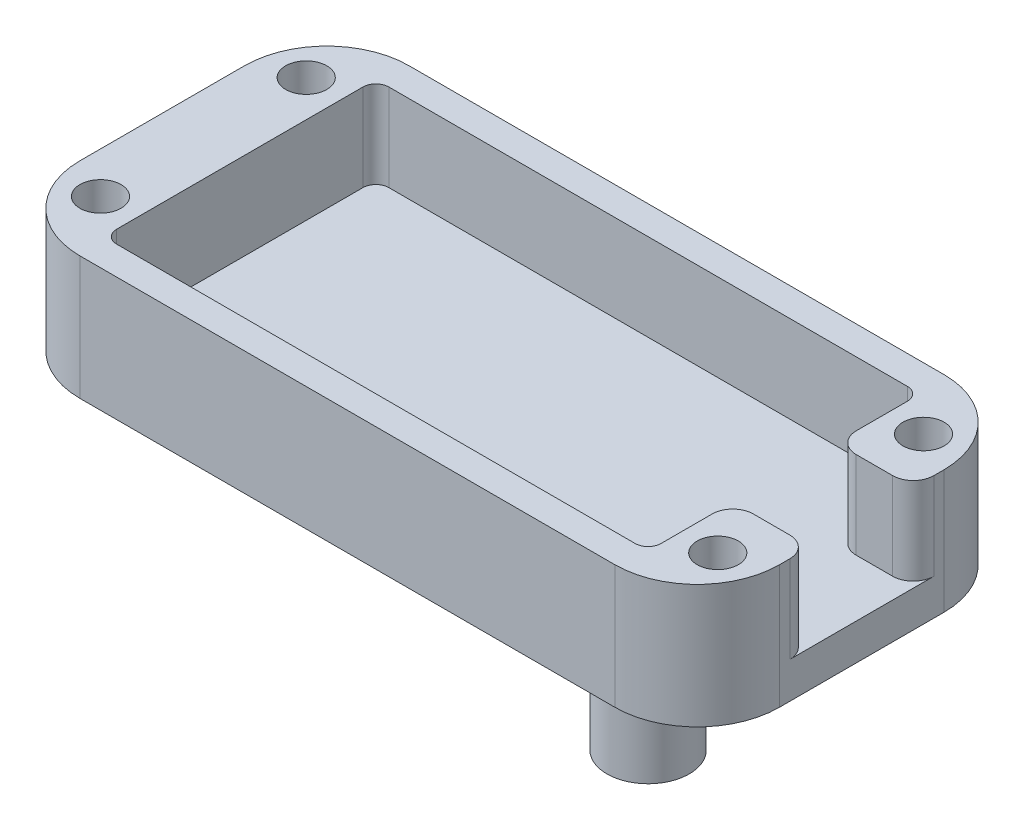
ISO-10303-21;
HEADER;
FILE_DESCRIPTION(('STEP AP214'),'2;1');
FILE_NAME('part.step','',(''),(''),'','','');
FILE_SCHEMA(('AUTOMOTIVE_DESIGN { 1 0 10303 214 1 1 1 1 }'));
ENDSEC;
DATA;
#1=APPLICATION_CONTEXT('core data for automotive mechanical design processes');
#2=APPLICATION_PROTOCOL_DEFINITION('international standard','automotive_design',2000,#1);
#3=PRODUCT_CONTEXT('',#1,'mechanical');
#4=PRODUCT('Part','Part','',(#3));
#5=PRODUCT_RELATED_PRODUCT_CATEGORY('part','',(#4));
#6=PRODUCT_DEFINITION_FORMATION('','',#4);
#7=PRODUCT_DEFINITION_CONTEXT('part definition',#1,'design');
#8=PRODUCT_DEFINITION('design','',#6,#7);
#9=PRODUCT_DEFINITION_SHAPE('','',#8);
#10=(LENGTH_UNIT() NAMED_UNIT(*) SI_UNIT(.MILLI.,.METRE.));
#11=(NAMED_UNIT(*) PLANE_ANGLE_UNIT() SI_UNIT($,.RADIAN.));
#12=(NAMED_UNIT(*) SI_UNIT($,.STERADIAN.) SOLID_ANGLE_UNIT());
#13=UNCERTAINTY_MEASURE_WITH_UNIT(LENGTH_MEASURE(1.E-05),#10,'distance_accuracy_value','');
#14=(GEOMETRIC_REPRESENTATION_CONTEXT(3) GLOBAL_UNCERTAINTY_ASSIGNED_CONTEXT((#13)) GLOBAL_UNIT_ASSIGNED_CONTEXT((#10,
#11,#12)) REPRESENTATION_CONTEXT('',''));
#15=CARTESIAN_POINT('',(0.,0.,0.));
#16=DIRECTION('',(0.,0.,1.));
#17=DIRECTION('',(1.,0.,0.));
#18=AXIS2_PLACEMENT_3D('',#15,#16,#17);
#19=CARTESIAN_POINT('',(47.9875,2.8,-23.2));
#20=DIRECTION('',(1.,0.,0.));
#21=DIRECTION('',(0.,0.,-1.));
#22=AXIS2_PLACEMENT_3D('',#19,#20,#21);
#23=PLANE('',#22);
#24=DIRECTION('',(0.,0.,-1.));
#25=VECTOR('',#24,1.);
#26=CARTESIAN_POINT('',(47.9875,9.525,-23.2));
#27=LINE('',#26,#25);
#28=CARTESIAN_POINT('',(47.9875,9.525,-3.20000000000001));
#29=VERTEX_POINT('',#28);
#30=CARTESIAN_POINT('',(47.9875,9.525,-7.14375));
#31=VERTEX_POINT('',#30);
#32=EDGE_CURVE('E220',#29,#31,#27,.T.);
#33=ORIENTED_EDGE('',*,*,#32,.T.);
#34=DIRECTION('',(0.,1.,0.));
#35=VECTOR('',#34,1.);
#36=CARTESIAN_POINT('',(47.9875,2.8,-7.14375));
#37=LINE('',#36,#35);
#38=CARTESIAN_POINT('',(47.9875,2.8,-7.14375));
#39=VERTEX_POINT('',#38);
#40=EDGE_CURVE('E343',#31,#39,#37,.F.);
#41=ORIENTED_EDGE('',*,*,#40,.T.);
#42=DIRECTION('',(0.,0.,-1.));
#43=VECTOR('',#42,1.);
#44=CARTESIAN_POINT('',(47.9875,2.8,-23.2));
#45=LINE('',#44,#43);
#46=CARTESIAN_POINT('',(47.9875,2.8,-3.20000000000001));
#47=VERTEX_POINT('',#46);
#48=EDGE_CURVE('E431',#47,#39,#45,.T.);
#49=ORIENTED_EDGE('',*,*,#48,.F.);
#50=DIRECTION('',(0.,1.,0.));
#51=VECTOR('',#50,1.);
#52=CARTESIAN_POINT('',(47.9875,9.525,-3.2));
#53=LINE('',#52,#51);
#54=EDGE_CURVE('E272',#47,#29,#53,.T.);
#55=ORIENTED_EDGE('',*,*,#54,.T.);
#56=EDGE_LOOP('',(#33,#41,#49,#55));
#57=FACE_BOUND('',#56,.T.);
#58=ADVANCED_FACE('F32',(#57),#23,.F.);
#59=CARTESIAN_POINT('',(0.,9.525,0.));
#60=DIRECTION('',(1.,0.,0.));
#61=DIRECTION('',(0.,0.,-1.));
#62=AXIS2_PLACEMENT_3D('',#59,#60,#61);
#63=PLANE('',#62);
#64=DIRECTION('',(0.,0.,1.));
#65=VECTOR('',#64,1.);
#66=CARTESIAN_POINT('',(0.,9.525,0.));
#67=LINE('',#66,#65);
#68=CARTESIAN_POINT('',(0.,9.525,-19.05));
#69=VERTEX_POINT('',#68);
#70=CARTESIAN_POINT('',(0.,9.525,-6.35));
#71=VERTEX_POINT('',#70);
#72=EDGE_CURVE('E231',#69,#71,#67,.T.);
#73=ORIENTED_EDGE('',*,*,#72,.F.);
#74=DIRECTION('',(0.,-1.,0.));
#75=VECTOR('',#74,1.);
#76=CARTESIAN_POINT('',(0.,9.525,-19.05));
#77=LINE('',#76,#75);
#78=CARTESIAN_POINT('',(0.,0.,-19.05));
#79=VERTEX_POINT('',#78);
#80=EDGE_CURVE('E319',#69,#79,#77,.T.);
#81=ORIENTED_EDGE('',*,*,#80,.T.);
#82=DIRECTION('',(0.,0.,1.));
#83=VECTOR('',#82,1.);
#84=CARTESIAN_POINT('',(0.,0.,0.));
#85=LINE('',#84,#83);
#86=CARTESIAN_POINT('',(0.,0.,-6.35));
#87=VERTEX_POINT('',#86);
#88=EDGE_CURVE('E245',#79,#87,#85,.T.);
#89=ORIENTED_EDGE('',*,*,#88,.T.);
#90=DIRECTION('',(0.,-1.,0.));
#91=VECTOR('',#90,1.);
#92=CARTESIAN_POINT('',(0.,9.525,-6.35));
#93=LINE('',#92,#91);
#94=EDGE_CURVE('E317',#87,#71,#93,.F.);
#95=ORIENTED_EDGE('',*,*,#94,.T.);
#96=EDGE_LOOP('',(#73,#81,#89,#95));
#97=FACE_BOUND('',#96,.T.);
#98=ADVANCED_FACE('F393',(#97),#63,.F.);
#99=CARTESIAN_POINT('',(0.,9.525,0.));
#100=DIRECTION('',(0.,0.,-1.));
#101=DIRECTION('',(-1.,0.,0.));
#102=AXIS2_PLACEMENT_3D('',#99,#100,#101);
#103=PLANE('',#102);
#104=DIRECTION('',(1.,0.,0.));
#105=VECTOR('',#104,1.);
#106=CARTESIAN_POINT('',(0.,0.,0.));
#107=LINE('',#106,#105);
#108=CARTESIAN_POINT('',(6.35,0.,0.));
#109=VERTEX_POINT('',#108);
#110=CARTESIAN_POINT('',(47.625,0.,0.));
#111=VERTEX_POINT('',#110);
#112=EDGE_CURVE('E248',#109,#111,#107,.T.);
#113=ORIENTED_EDGE('',*,*,#112,.T.);
#114=DIRECTION('',(0.,-1.,0.));
#115=VECTOR('',#114,1.);
#116=CARTESIAN_POINT('',(47.625,9.525,0.));
#117=LINE('',#116,#115);
#118=CARTESIAN_POINT('',(47.625,9.525,0.));
#119=VERTEX_POINT('',#118);
#120=EDGE_CURVE('E302',#111,#119,#117,.F.);
#121=ORIENTED_EDGE('',*,*,#120,.T.);
#122=DIRECTION('',(1.,0.,0.));
#123=VECTOR('',#122,1.);
#124=CARTESIAN_POINT('',(0.,9.525,0.));
#125=LINE('',#124,#123);
#126=CARTESIAN_POINT('',(6.35,9.525,0.));
#127=VERTEX_POINT('',#126);
#128=EDGE_CURVE('E234',#127,#119,#125,.T.);
#129=ORIENTED_EDGE('',*,*,#128,.F.);
#130=DIRECTION('',(0.,-1.,0.));
#131=VECTOR('',#130,1.);
#132=CARTESIAN_POINT('',(6.35,9.525,0.));
#133=LINE('',#132,#131);
#134=EDGE_CURVE('E299',#127,#109,#133,.T.);
#135=ORIENTED_EDGE('',*,*,#134,.T.);
#136=EDGE_LOOP('',(#113,#121,#129,#135));
#137=FACE_BOUND('',#136,.T.);
#138=ADVANCED_FACE('F400',(#137),#103,.F.);
#139=CARTESIAN_POINT('',(53.975,9.525,0.));
#140=DIRECTION('',(-1.,0.,0.));
#141=DIRECTION('',(0.,0.,1.));
#142=AXIS2_PLACEMENT_3D('',#139,#140,#141);
#143=PLANE('',#142);
#144=DIRECTION('',(0.,0.,1.));
#145=VECTOR('',#144,1.);
#146=CARTESIAN_POINT('',(53.975,2.8,-8.73125));
#147=LINE('',#146,#145);
#148=CARTESIAN_POINT('',(53.975,2.8,-18.25625));
#149=VERTEX_POINT('',#148);
#150=CARTESIAN_POINT('',(53.975,2.8,-7.14375));
#151=VERTEX_POINT('',#150);
#152=EDGE_CURVE('E47',#149,#151,#147,.T.);
#153=ORIENTED_EDGE('',*,*,#152,.T.);
#154=DIRECTION('',(0.,1.,0.));
#155=VECTOR('',#154,1.);
#156=CARTESIAN_POINT('',(53.975,9.525,-7.14375));
#157=LINE('',#156,#155);
#158=CARTESIAN_POINT('',(53.975,9.525,-7.14375));
#159=VERTEX_POINT('',#158);
#160=EDGE_CURVE('E347',#151,#159,#157,.T.);
#161=ORIENTED_EDGE('',*,*,#160,.T.);
#162=DIRECTION('',(0.,0.,-1.));
#163=VECTOR('',#162,1.);
#164=CARTESIAN_POINT('',(53.975,9.525,0.));
#165=LINE('',#164,#163);
#166=CARTESIAN_POINT('',(53.975,9.525,-6.35));
#167=VERTEX_POINT('',#166);
#168=EDGE_CURVE('E239',#167,#159,#165,.T.);
#169=ORIENTED_EDGE('',*,*,#168,.F.);
#170=DIRECTION('',(0.,-1.,0.));
#171=VECTOR('',#170,1.);
#172=CARTESIAN_POINT('',(53.975,9.525,-6.35));
#173=LINE('',#172,#171);
#174=CARTESIAN_POINT('',(53.975,0.,-6.35));
#175=VERTEX_POINT('',#174);
#176=EDGE_CURVE('E288',#167,#175,#173,.T.);
#177=ORIENTED_EDGE('',*,*,#176,.T.);
#178=DIRECTION('',(0.,0.,-1.));
#179=VECTOR('',#178,1.);
#180=CARTESIAN_POINT('',(53.975,0.,0.));
#181=LINE('',#180,#179);
#182=CARTESIAN_POINT('',(53.975,0.,-19.05));
#183=VERTEX_POINT('',#182);
#184=EDGE_CURVE('E252',#175,#183,#181,.T.);
#185=ORIENTED_EDGE('',*,*,#184,.T.);
#186=DIRECTION('',(0.,-1.,0.));
#187=VECTOR('',#186,1.);
#188=CARTESIAN_POINT('',(53.975,9.525,-19.05));
#189=LINE('',#188,#187);
#190=CARTESIAN_POINT('',(53.975,9.525,-19.05));
#191=VERTEX_POINT('',#190);
#192=EDGE_CURVE('E285',#183,#191,#189,.F.);
#193=ORIENTED_EDGE('',*,*,#192,.T.);
#194=CARTESIAN_POINT('',(53.975,9.525,-18.25625));
#195=VERTEX_POINT('',#194);
#196=EDGE_CURVE('E238',#195,#191,#165,.T.);
#197=ORIENTED_EDGE('',*,*,#196,.F.);
#198=DIRECTION('',(0.,1.,0.));
#199=VECTOR('',#198,1.);
#200=CARTESIAN_POINT('',(53.975,9.525,-18.25625));
#201=LINE('',#200,#199);
#202=EDGE_CURVE('E345',#195,#149,#201,.F.);
#203=ORIENTED_EDGE('',*,*,#202,.T.);
#204=EDGE_LOOP('',(#153,#161,#169,#177,#185,#193,#197,#203));
#205=FACE_BOUND('',#204,.T.);
#206=ADVANCED_FACE('F363',(#205),#143,.F.);
#207=CARTESIAN_POINT('',(0.,9.525,-25.4));
#208=DIRECTION('',(0.,0.,1.));
#209=DIRECTION('',(1.,0.,0.));
#210=AXIS2_PLACEMENT_3D('',#207,#208,#209);
#211=PLANE('',#210);
#212=DIRECTION('',(-1.,0.,0.));
#213=VECTOR('',#212,1.);
#214=CARTESIAN_POINT('',(0.,9.525,-25.4));
#215=LINE('',#214,#213);
#216=CARTESIAN_POINT('',(47.625,9.525,-25.4));
#217=VERTEX_POINT('',#216);
#218=CARTESIAN_POINT('',(6.35,9.525,-25.4));
#219=VERTEX_POINT('',#218);
#220=EDGE_CURVE('E242',#217,#219,#215,.T.);
#221=ORIENTED_EDGE('',*,*,#220,.F.);
#222=DIRECTION('',(0.,-1.,0.));
#223=VECTOR('',#222,1.);
#224=CARTESIAN_POINT('',(47.625,9.525,-25.4));
#225=LINE('',#224,#223);
#226=CARTESIAN_POINT('',(47.625,0.,-25.4));
#227=VERTEX_POINT('',#226);
#228=EDGE_CURVE('E314',#217,#227,#225,.T.);
#229=ORIENTED_EDGE('',*,*,#228,.T.);
#230=DIRECTION('',(-1.,0.,0.));
#231=VECTOR('',#230,1.);
#232=CARTESIAN_POINT('',(0.,0.,-25.4));
#233=LINE('',#232,#231);
#234=CARTESIAN_POINT('',(6.35,0.,-25.4));
#235=VERTEX_POINT('',#234);
#236=EDGE_CURVE('E235',#227,#235,#233,.T.);
#237=ORIENTED_EDGE('',*,*,#236,.T.);
#238=DIRECTION('',(0.,-1.,0.));
#239=VECTOR('',#238,1.);
#240=CARTESIAN_POINT('',(6.35,9.525,-25.4));
#241=LINE('',#240,#239);
#242=EDGE_CURVE('E312',#235,#219,#241,.F.);
#243=ORIENTED_EDGE('',*,*,#242,.T.);
#244=EDGE_LOOP('',(#221,#229,#237,#243));
#245=FACE_BOUND('',#244,.T.);
#246=ADVANCED_FACE('F384',(#245),#211,.F.);
#247=CARTESIAN_POINT('',(0.,9.525,0.));
#248=DIRECTION('',(0.,-1.,0.));
#249=DIRECTION('',(0.,0.,-1.));
#250=AXIS2_PLACEMENT_3D('',#247,#248,#249);
#251=PLANE('',#250);
#252=CARTESIAN_POINT('',(3.175,9.525,-4.7625));
#253=DIRECTION('',(0.,1.,0.));
#254=DIRECTION('',(0.,0.,1.));
#255=AXIS2_PLACEMENT_3D('',#252,#253,#254);
#256=CIRCLE('',#255,1.5875);
#257=CARTESIAN_POINT('',(3.175,9.525,-3.175));
#258=VERTEX_POINT('',#257);
#259=EDGE_CURVE('E460',#258,#258,#256,.T.);
#260=ORIENTED_EDGE('',*,*,#259,.F.);
#261=EDGE_LOOP('',(#260));
#262=FACE_BOUND('',#261,.T.);
#263=CARTESIAN_POINT('',(50.8,9.525,-20.6375));
#264=DIRECTION('',(0.,1.,0.));
#265=DIRECTION('',(0.,0.,1.));
#266=AXIS2_PLACEMENT_3D('',#263,#264,#265);
#267=CIRCLE('',#266,1.5875);
#268=CARTESIAN_POINT('',(50.8,9.525,-19.05));
#269=VERTEX_POINT('',#268);
#270=EDGE_CURVE('E459',#269,#269,#267,.T.);
#271=ORIENTED_EDGE('',*,*,#270,.F.);
#272=EDGE_LOOP('',(#271));
#273=FACE_BOUND('',#272,.T.);
#274=CARTESIAN_POINT('',(50.8,9.525,-4.7625));
#275=DIRECTION('',(0.,1.,0.));
#276=DIRECTION('',(0.,0.,1.));
#277=AXIS2_PLACEMENT_3D('',#274,#275,#276);
#278=CIRCLE('',#277,1.5875);
#279=CARTESIAN_POINT('',(50.8,9.525,-3.175));
#280=VERTEX_POINT('',#279);
#281=EDGE_CURVE('E453',#280,#280,#278,.T.);
#282=ORIENTED_EDGE('',*,*,#281,.F.);
#283=EDGE_LOOP('',(#282));
#284=FACE_BOUND('',#283,.T.);
#285=CARTESIAN_POINT('',(3.175,9.525,-20.6375));
#286=DIRECTION('',(0.,1.,0.));
#287=DIRECTION('',(0.,0.,1.));
#288=AXIS2_PLACEMENT_3D('',#285,#286,#287);
#289=CIRCLE('',#288,1.5875);
#290=CARTESIAN_POINT('',(3.175,9.525,-19.05));
#291=VERTEX_POINT('',#290);
#292=EDGE_CURVE('E467',#291,#291,#289,.T.);
#293=ORIENTED_EDGE('',*,*,#292,.F.);
#294=EDGE_LOOP('',(#293));
#295=FACE_BOUND('',#294,.T.);
#296=CARTESIAN_POINT('',(47.9875,9.525,-18.25625));
#297=VERTEX_POINT('',#296);
#298=CARTESIAN_POINT('',(47.9875,9.525,-22.2));
#299=VERTEX_POINT('',#298);
#300=EDGE_CURVE('E217',#297,#299,#27,.T.);
#301=ORIENTED_EDGE('',*,*,#300,.F.);
#302=CARTESIAN_POINT('',(49.575,9.525,-18.25625));
#303=DIRECTION('',(0.,-1.,0.));
#304=DIRECTION('',(0.,0.,-1.));
#305=AXIS2_PLACEMENT_3D('',#302,#303,#304);
#306=CIRCLE('',#305,1.5875);
#307=CARTESIAN_POINT('',(49.575,9.525,-16.66875));
#308=VERTEX_POINT('',#307);
#309=EDGE_CURVE('E331',#297,#308,#306,.F.);
#310=ORIENTED_EDGE('',*,*,#309,.T.);
#311=DIRECTION('',(-1.,0.,0.));
#312=VECTOR('',#311,1.);
#313=CARTESIAN_POINT('',(47.9875,9.525,-16.66875));
#314=LINE('',#313,#312);
#315=CARTESIAN_POINT('',(52.3875,9.525,-16.66875));
#316=VERTEX_POINT('',#315);
#317=EDGE_CURVE('E439',#316,#308,#314,.T.);
#318=ORIENTED_EDGE('',*,*,#317,.F.);
#319=CARTESIAN_POINT('',(52.3875,9.525,-18.25625));
#320=DIRECTION('',(0.,-1.,0.));
#321=DIRECTION('',(0.,0.,-1.));
#322=AXIS2_PLACEMENT_3D('',#319,#320,#321);
#323=CIRCLE('',#322,1.5875);
#324=EDGE_CURVE('E325',#316,#195,#323,.F.);
#325=ORIENTED_EDGE('',*,*,#324,.T.);
#326=ORIENTED_EDGE('',*,*,#196,.T.);
#327=CARTESIAN_POINT('',(47.625,9.525,-19.05));
#328=DIRECTION('',(0.,-1.,0.));
#329=DIRECTION('',(0.,0.,-1.));
#330=AXIS2_PLACEMENT_3D('',#327,#328,#329);
#331=CIRCLE('',#330,6.35);
#332=EDGE_CURVE('E308',#191,#217,#331,.F.);
#333=ORIENTED_EDGE('',*,*,#332,.T.);
#334=ORIENTED_EDGE('',*,*,#220,.T.);
#335=CARTESIAN_POINT('',(6.35,9.525,-19.05));
#336=DIRECTION('',(0.,-1.,0.));
#337=DIRECTION('',(0.,0.,-1.));
#338=AXIS2_PLACEMENT_3D('',#335,#336,#337);
#339=CIRCLE('',#338,6.35);
#340=EDGE_CURVE('E306',#219,#69,#339,.F.);
#341=ORIENTED_EDGE('',*,*,#340,.T.);
#342=ORIENTED_EDGE('',*,*,#72,.T.);
#343=CARTESIAN_POINT('',(6.35,9.525,-6.35));
#344=DIRECTION('',(0.,-1.,0.));
#345=DIRECTION('',(0.,0.,-1.));
#346=AXIS2_PLACEMENT_3D('',#343,#344,#345);
#347=CIRCLE('',#346,6.35);
#348=EDGE_CURVE('E304',#71,#127,#347,.F.);
#349=ORIENTED_EDGE('',*,*,#348,.T.);
#350=ORIENTED_EDGE('',*,*,#128,.T.);
#351=CARTESIAN_POINT('',(47.625,9.525,-6.35));
#352=DIRECTION('',(0.,-1.,0.));
#353=DIRECTION('',(0.,0.,-1.));
#354=AXIS2_PLACEMENT_3D('',#351,#352,#353);
#355=CIRCLE('',#354,6.35);
#356=EDGE_CURVE('E310',#119,#167,#355,.F.);
#357=ORIENTED_EDGE('',*,*,#356,.T.);
#358=ORIENTED_EDGE('',*,*,#168,.T.);
#359=CARTESIAN_POINT('',(52.3875,9.525,-7.14375));
#360=DIRECTION('',(0.,-1.,0.));
#361=DIRECTION('',(0.,0.,-1.));
#362=AXIS2_PLACEMENT_3D('',#359,#360,#361);
#363=CIRCLE('',#362,1.5875);
#364=CARTESIAN_POINT('',(52.3875,9.525,-8.73125));
#365=VERTEX_POINT('',#364);
#366=EDGE_CURVE('E327',#159,#365,#363,.F.);
#367=ORIENTED_EDGE('',*,*,#366,.T.);
#368=DIRECTION('',(1.,0.,0.));
#369=VECTOR('',#368,1.);
#370=CARTESIAN_POINT('',(53.975,9.525,-8.73125));
#371=LINE('',#370,#369);
#372=CARTESIAN_POINT('',(49.575,9.525,-8.73125));
#373=VERTEX_POINT('',#372);
#374=EDGE_CURVE('E446',#373,#365,#371,.T.);
#375=ORIENTED_EDGE('',*,*,#374,.F.);
#376=CARTESIAN_POINT('',(49.575,9.525,-7.14375));
#377=DIRECTION('',(0.,-1.,0.));
#378=DIRECTION('',(0.,0.,-1.));
#379=AXIS2_PLACEMENT_3D('',#376,#377,#378);
#380=CIRCLE('',#379,1.5875);
#381=EDGE_CURVE('E329',#373,#31,#380,.F.);
#382=ORIENTED_EDGE('',*,*,#381,.T.);
#383=ORIENTED_EDGE('',*,*,#32,.F.);
#384=CARTESIAN_POINT('',(46.9875,9.525,-3.2));
#385=DIRECTION('',(0.,-1.,0.));
#386=DIRECTION('',(0.,0.,-1.));
#387=AXIS2_PLACEMENT_3D('',#384,#385,#386);
#388=CIRCLE('',#387,1.);
#389=CARTESIAN_POINT('',(46.9875,9.525,-2.2));
#390=VERTEX_POINT('',#389);
#391=EDGE_CURVE('E200',#29,#390,#388,.T.);
#392=ORIENTED_EDGE('',*,*,#391,.T.);
#393=DIRECTION('',(1.,0.,0.));
#394=VECTOR('',#393,1.);
#395=CARTESIAN_POINT('',(5.98749999999999,9.525,-2.2));
#396=LINE('',#395,#394);
#397=CARTESIAN_POINT('',(6.98749999999999,9.525,-2.2));
#398=VERTEX_POINT('',#397);
#399=EDGE_CURVE('E207',#398,#390,#396,.T.);
#400=ORIENTED_EDGE('',*,*,#399,.F.);
#401=CARTESIAN_POINT('',(6.98749999999999,9.525,-3.2));
#402=DIRECTION('',(0.,-1.,0.));
#403=DIRECTION('',(0.,0.,-1.));
#404=AXIS2_PLACEMENT_3D('',#401,#402,#403);
#405=CIRCLE('',#404,1.);
#406=CARTESIAN_POINT('',(5.98749999999999,9.525,-3.19999999999999));
#407=VERTEX_POINT('',#406);
#408=EDGE_CURVE('E190',#398,#407,#405,.T.);
#409=ORIENTED_EDGE('',*,*,#408,.T.);
#410=DIRECTION('',(0.,0.,1.));
#411=VECTOR('',#410,1.);
#412=CARTESIAN_POINT('',(5.98749999999999,9.525,-23.2));
#413=LINE('',#412,#411);
#414=CARTESIAN_POINT('',(5.98749999999999,9.525,-22.2));
#415=VERTEX_POINT('',#414);
#416=EDGE_CURVE('E218',#415,#407,#413,.T.);
#417=ORIENTED_EDGE('',*,*,#416,.F.);
#418=CARTESIAN_POINT('',(6.98749999999999,9.525,-22.2));
#419=DIRECTION('',(0.,-1.,0.));
#420=DIRECTION('',(0.,0.,-1.));
#421=AXIS2_PLACEMENT_3D('',#418,#419,#420);
#422=CIRCLE('',#421,1.);
#423=CARTESIAN_POINT('',(6.98749999999999,9.525,-23.2));
#424=VERTEX_POINT('',#423);
#425=EDGE_CURVE('E280',#415,#424,#422,.T.);
#426=ORIENTED_EDGE('',*,*,#425,.T.);
#427=DIRECTION('',(-1.,0.,0.));
#428=VECTOR('',#427,1.);
#429=CARTESIAN_POINT('',(5.98749999999999,9.525,-23.2));
#430=LINE('',#429,#428);
#431=CARTESIAN_POINT('',(46.9875,9.525,-23.2));
#432=VERTEX_POINT('',#431);
#433=EDGE_CURVE('E227',#432,#424,#430,.T.);
#434=ORIENTED_EDGE('',*,*,#433,.F.);
#435=CARTESIAN_POINT('',(46.9875,9.525,-22.2));
#436=DIRECTION('',(0.,-1.,0.));
#437=DIRECTION('',(0.,0.,-1.));
#438=AXIS2_PLACEMENT_3D('',#435,#436,#437);
#439=CIRCLE('',#438,1.);
#440=EDGE_CURVE('E282',#432,#299,#439,.T.);
#441=ORIENTED_EDGE('',*,*,#440,.T.);
#442=EDGE_LOOP('',(#301,#310,#318,#325,#326,#333,#334,#341,#342,#349,#350,#357,#358,#367,#375,
#382,#383,#392,#400,#409,#417,#426,#434,#441));
#443=FACE_BOUND('',#442,.T.);
#444=ADVANCED_FACE('F215',(#262,#273,#284,#295,#443),#251,.F.);
#445=CARTESIAN_POINT('',(0.,0.,0.));
#446=DIRECTION('',(0.,-1.,0.));
#447=DIRECTION('',(0.,0.,-1.));
#448=AXIS2_PLACEMENT_3D('',#445,#446,#447);
#449=PLANE('',#448);
#450=CARTESIAN_POINT('',(3.175,0.,-4.7625));
#451=DIRECTION('',(0.,-1.,0.));
#452=DIRECTION('',(0.,0.,-1.));
#453=AXIS2_PLACEMENT_3D('',#450,#451,#452);
#454=CIRCLE('',#453,1.5875);
#455=CARTESIAN_POINT('',(3.175,0.,-6.35));
#456=VERTEX_POINT('',#455);
#457=EDGE_CURVE('E463',#456,#456,#454,.F.);
#458=ORIENTED_EDGE('',*,*,#457,.T.);
#459=EDGE_LOOP('',(#458));
#460=FACE_BOUND('',#459,.T.);
#461=CARTESIAN_POINT('',(50.8,0.,-20.6375));
#462=DIRECTION('',(0.,-1.,0.));
#463=DIRECTION('',(0.,0.,-1.));
#464=AXIS2_PLACEMENT_3D('',#461,#462,#463);
#465=CIRCLE('',#464,1.5875);
#466=CARTESIAN_POINT('',(50.8,0.,-22.225));
#467=VERTEX_POINT('',#466);
#468=EDGE_CURVE('E464',#467,#467,#465,.F.);
#469=ORIENTED_EDGE('',*,*,#468,.T.);
#470=EDGE_LOOP('',(#469));
#471=FACE_BOUND('',#470,.T.);
#472=CARTESIAN_POINT('',(50.8,0.,-4.7625));
#473=DIRECTION('',(0.,-1.,0.));
#474=DIRECTION('',(0.,0.,-1.));
#475=AXIS2_PLACEMENT_3D('',#472,#473,#474);
#476=CIRCLE('',#475,1.5875);
#477=CARTESIAN_POINT('',(50.8,0.,-6.35));
#478=VERTEX_POINT('',#477);
#479=EDGE_CURVE('E456',#478,#478,#476,.F.);
#480=ORIENTED_EDGE('',*,*,#479,.T.);
#481=EDGE_LOOP('',(#480));
#482=FACE_BOUND('',#481,.T.);
#483=CARTESIAN_POINT('',(3.175,0.,-20.6375));
#484=DIRECTION('',(0.,-1.,0.));
#485=DIRECTION('',(0.,0.,-1.));
#486=AXIS2_PLACEMENT_3D('',#483,#484,#485);
#487=CIRCLE('',#486,1.5875);
#488=CARTESIAN_POINT('',(3.175,0.,-22.225));
#489=VERTEX_POINT('',#488);
#490=EDGE_CURVE('E474',#489,#489,#487,.F.);
#491=ORIENTED_EDGE('',*,*,#490,.T.);
#492=EDGE_LOOP('',(#491));
#493=FACE_BOUND('',#492,.T.);
#494=CARTESIAN_POINT('',(37.4875,0.,-12.7));
#495=DIRECTION('',(0.,-1.,0.));
#496=DIRECTION('',(0.,0.,-1.));
#497=AXIS2_PLACEMENT_3D('',#494,#495,#496);
#498=CIRCLE('',#497,3.175);
#499=CARTESIAN_POINT('',(37.4875,0.,-15.875));
#500=VERTEX_POINT('',#499);
#501=EDGE_CURVE('E477',#500,#500,#498,.T.);
#502=ORIENTED_EDGE('',*,*,#501,.F.);
#503=EDGE_LOOP('',(#502));
#504=FACE_BOUND('',#503,.T.);
#505=ORIENTED_EDGE('',*,*,#184,.F.);
#506=CARTESIAN_POINT('',(47.625,0.,-6.35));
#507=DIRECTION('',(0.,-1.,0.));
#508=DIRECTION('',(0.,0.,-1.));
#509=AXIS2_PLACEMENT_3D('',#506,#507,#508);
#510=CIRCLE('',#509,6.35);
#511=EDGE_CURVE('E297',#175,#111,#510,.T.);
#512=ORIENTED_EDGE('',*,*,#511,.T.);
#513=ORIENTED_EDGE('',*,*,#112,.F.);
#514=CARTESIAN_POINT('',(6.35,0.,-6.35));
#515=DIRECTION('',(0.,-1.,0.));
#516=DIRECTION('',(0.,0.,-1.));
#517=AXIS2_PLACEMENT_3D('',#514,#515,#516);
#518=CIRCLE('',#517,6.35);
#519=EDGE_CURVE('E291',#109,#87,#518,.T.);
#520=ORIENTED_EDGE('',*,*,#519,.T.);
#521=ORIENTED_EDGE('',*,*,#88,.F.);
#522=CARTESIAN_POINT('',(6.35,0.,-19.05));
#523=DIRECTION('',(0.,-1.,0.));
#524=DIRECTION('',(0.,0.,-1.));
#525=AXIS2_PLACEMENT_3D('',#522,#523,#524);
#526=CIRCLE('',#525,6.35);
#527=EDGE_CURVE('E293',#79,#235,#526,.T.);
#528=ORIENTED_EDGE('',*,*,#527,.T.);
#529=ORIENTED_EDGE('',*,*,#236,.F.);
#530=CARTESIAN_POINT('',(47.625,0.,-19.05));
#531=DIRECTION('',(0.,-1.,0.));
#532=DIRECTION('',(0.,0.,-1.));
#533=AXIS2_PLACEMENT_3D('',#530,#531,#532);
#534=CIRCLE('',#533,6.35);
#535=EDGE_CURVE('E295',#227,#183,#534,.T.);
#536=ORIENTED_EDGE('',*,*,#535,.T.);
#537=EDGE_LOOP('',(#505,#512,#513,#520,#521,#528,#529,#536));
#538=FACE_BOUND('',#537,.T.);
#539=ADVANCED_FACE('F375',(#460,#471,#482,#493,#504,#538),#449,.T.);
#540=CARTESIAN_POINT('',(5.98749999999999,2.8,-23.2));
#541=DIRECTION('',(-1.,0.,0.));
#542=DIRECTION('',(0.,0.,1.));
#543=AXIS2_PLACEMENT_3D('',#540,#541,#542);
#544=PLANE('',#543);
#545=ORIENTED_EDGE('',*,*,#416,.T.);
#546=DIRECTION('',(0.,1.,0.));
#547=VECTOR('',#546,1.);
#548=CARTESIAN_POINT('',(5.98749999999999,2.8,-3.2));
#549=LINE('',#548,#547);
#550=CARTESIAN_POINT('',(5.98749999999999,2.8,-3.19999999999999));
#551=VERTEX_POINT('',#550);
#552=EDGE_CURVE('E195',#407,#551,#549,.F.);
#553=ORIENTED_EDGE('',*,*,#552,.T.);
#554=DIRECTION('',(0.,0.,1.));
#555=VECTOR('',#554,1.);
#556=CARTESIAN_POINT('',(5.98749999999999,2.8,-23.2));
#557=LINE('',#556,#555);
#558=CARTESIAN_POINT('',(5.98749999999999,2.8,-22.2));
#559=VERTEX_POINT('',#558);
#560=EDGE_CURVE('E230',#559,#551,#557,.T.);
#561=ORIENTED_EDGE('',*,*,#560,.F.);
#562=DIRECTION('',(0.,1.,0.));
#563=VECTOR('',#562,1.);
#564=CARTESIAN_POINT('',(5.98749999999999,9.525,-22.2));
#565=LINE('',#564,#563);
#566=EDGE_CURVE('E211',#559,#415,#565,.T.);
#567=ORIENTED_EDGE('',*,*,#566,.T.);
#568=EDGE_LOOP('',(#545,#553,#561,#567));
#569=FACE_BOUND('',#568,.T.);
#570=ADVANCED_FACE('F424',(#569),#544,.F.);
#571=CARTESIAN_POINT('',(5.98749999999999,2.8,-23.2));
#572=DIRECTION('',(0.,0.,-1.));
#573=DIRECTION('',(-1.,0.,0.));
#574=AXIS2_PLACEMENT_3D('',#571,#572,#573);
#575=PLANE('',#574);
#576=ORIENTED_EDGE('',*,*,#433,.T.);
#577=DIRECTION('',(0.,1.,0.));
#578=VECTOR('',#577,1.);
#579=CARTESIAN_POINT('',(6.98749999999999,2.8,-23.2));
#580=LINE('',#579,#578);
#581=CARTESIAN_POINT('',(6.98749999999999,2.8,-23.2));
#582=VERTEX_POINT('',#581);
#583=EDGE_CURVE('E201',#424,#582,#580,.F.);
#584=ORIENTED_EDGE('',*,*,#583,.T.);
#585=DIRECTION('',(-1.,0.,0.));
#586=VECTOR('',#585,1.);
#587=CARTESIAN_POINT('',(5.98749999999999,2.8,-23.2));
#588=LINE('',#587,#586);
#589=CARTESIAN_POINT('',(46.9875,2.8,-23.2));
#590=VERTEX_POINT('',#589);
#591=EDGE_CURVE('E249',#590,#582,#588,.T.);
#592=ORIENTED_EDGE('',*,*,#591,.F.);
#593=DIRECTION('',(0.,1.,0.));
#594=VECTOR('',#593,1.);
#595=CARTESIAN_POINT('',(46.9875,9.525,-23.2));
#596=LINE('',#595,#594);
#597=EDGE_CURVE('E275',#590,#432,#596,.T.);
#598=ORIENTED_EDGE('',*,*,#597,.T.);
#599=EDGE_LOOP('',(#576,#584,#592,#598));
#600=FACE_BOUND('',#599,.T.);
#601=ADVANCED_FACE('F418',(#600),#575,.F.);
#602=CARTESIAN_POINT('',(47.9875,2.8,-18.25625));
#603=VERTEX_POINT('',#602);
#604=CARTESIAN_POINT('',(47.9875,2.8,-22.2));
#605=VERTEX_POINT('',#604);
#606=EDGE_CURVE('E427',#603,#605,#45,.T.);
#607=ORIENTED_EDGE('',*,*,#606,.F.);
#608=DIRECTION('',(0.,1.,0.));
#609=VECTOR('',#608,1.);
#610=CARTESIAN_POINT('',(47.9875,2.8,-18.25625));
#611=LINE('',#610,#609);
#612=EDGE_CURVE('E322',#603,#297,#611,.T.);
#613=ORIENTED_EDGE('',*,*,#612,.T.);
#614=ORIENTED_EDGE('',*,*,#300,.T.);
#615=DIRECTION('',(0.,1.,0.));
#616=VECTOR('',#615,1.);
#617=CARTESIAN_POINT('',(47.9875,2.8,-22.2));
#618=LINE('',#617,#616);
#619=EDGE_CURVE('E269',#299,#605,#618,.F.);
#620=ORIENTED_EDGE('',*,*,#619,.T.);
#621=EDGE_LOOP('',(#607,#613,#614,#620));
#622=FACE_BOUND('',#621,.T.);
#623=ADVANCED_FACE('F412',(#622),#23,.F.);
#624=CARTESIAN_POINT('',(5.98749999999999,2.8,-2.2));
#625=DIRECTION('',(0.,0.,1.));
#626=DIRECTION('',(1.,0.,0.));
#627=AXIS2_PLACEMENT_3D('',#624,#625,#626);
#628=PLANE('',#627);
#629=DIRECTION('',(1.,0.,0.));
#630=VECTOR('',#629,1.);
#631=CARTESIAN_POINT('',(5.98749999999999,2.8,-2.2));
#632=LINE('',#631,#630);
#633=CARTESIAN_POINT('',(6.98749999999999,2.8,-2.2));
#634=VERTEX_POINT('',#633);
#635=CARTESIAN_POINT('',(46.9875,2.8,-2.2));
#636=VERTEX_POINT('',#635);
#637=EDGE_CURVE('E210',#634,#636,#632,.T.);
#638=ORIENTED_EDGE('',*,*,#637,.F.);
#639=DIRECTION('',(0.,1.,0.));
#640=VECTOR('',#639,1.);
#641=CARTESIAN_POINT('',(6.98749999999999,9.525,-2.2));
#642=LINE('',#641,#640);
#643=EDGE_CURVE('E194',#634,#398,#642,.T.);
#644=ORIENTED_EDGE('',*,*,#643,.T.);
#645=ORIENTED_EDGE('',*,*,#399,.T.);
#646=DIRECTION('',(0.,1.,0.));
#647=VECTOR('',#646,1.);
#648=CARTESIAN_POINT('',(46.9875,2.8,-2.2));
#649=LINE('',#648,#647);
#650=EDGE_CURVE('E212',#390,#636,#649,.F.);
#651=ORIENTED_EDGE('',*,*,#650,.T.);
#652=EDGE_LOOP('',(#638,#644,#645,#651));
#653=FACE_BOUND('',#652,.T.);
#654=ADVANCED_FACE('F206',(#653),#628,.F.);
#655=CARTESIAN_POINT('',(0.,2.8,0.));
#656=DIRECTION('',(0.,1.,0.));
#657=DIRECTION('',(0.,0.,1.));
#658=AXIS2_PLACEMENT_3D('',#655,#656,#657);
#659=PLANE('',#658);
#660=ORIENTED_EDGE('',*,*,#560,.T.);
#661=CARTESIAN_POINT('',(6.98749999999999,2.8,-3.2));
#662=DIRECTION('',(0.,1.,0.));
#663=DIRECTION('',(0.,0.,1.));
#664=AXIS2_PLACEMENT_3D('',#661,#662,#663);
#665=CIRCLE('',#664,1.);
#666=EDGE_CURVE('E267',#551,#634,#665,.T.);
#667=ORIENTED_EDGE('',*,*,#666,.T.);
#668=ORIENTED_EDGE('',*,*,#637,.T.);
#669=CARTESIAN_POINT('',(46.9875,2.8,-3.2));
#670=DIRECTION('',(0.,1.,0.));
#671=DIRECTION('',(0.,0.,1.));
#672=AXIS2_PLACEMENT_3D('',#669,#670,#671);
#673=CIRCLE('',#672,1.);
#674=EDGE_CURVE('E265',#636,#47,#673,.T.);
#675=ORIENTED_EDGE('',*,*,#674,.T.);
#676=ORIENTED_EDGE('',*,*,#48,.T.);
#677=CARTESIAN_POINT('',(49.575,2.8,-7.14375));
#678=DIRECTION('',(0.,1.,0.));
#679=DIRECTION('',(0.,0.,1.));
#680=AXIS2_PLACEMENT_3D('',#677,#678,#679);
#681=CIRCLE('',#680,1.5875);
#682=CARTESIAN_POINT('',(49.575,2.8,-8.73125));
#683=VERTEX_POINT('',#682);
#684=EDGE_CURVE('E351',#39,#683,#681,.F.);
#685=ORIENTED_EDGE('',*,*,#684,.T.);
#686=DIRECTION('',(-1.,0.,0.));
#687=VECTOR('',#686,1.);
#688=CARTESIAN_POINT('',(53.975,2.8,-8.73125));
#689=LINE('',#688,#687);
#690=CARTESIAN_POINT('',(52.3875,2.8,-8.73125));
#691=VERTEX_POINT('',#690);
#692=EDGE_CURVE('E358',#691,#683,#689,.T.);
#693=ORIENTED_EDGE('',*,*,#692,.F.);
#694=CARTESIAN_POINT('',(52.3875,2.8,-7.14375));
#695=DIRECTION('',(0.,1.,0.));
#696=DIRECTION('',(0.,0.,1.));
#697=AXIS2_PLACEMENT_3D('',#694,#695,#696);
#698=CIRCLE('',#697,1.5875);
#699=EDGE_CURVE('E40',#691,#151,#698,.F.);
#700=ORIENTED_EDGE('',*,*,#699,.T.);
#701=ORIENTED_EDGE('',*,*,#152,.F.);
#702=CARTESIAN_POINT('',(52.3875,2.8,-18.25625));
#703=DIRECTION('',(0.,1.,0.));
#704=DIRECTION('',(0.,0.,1.));
#705=AXIS2_PLACEMENT_3D('',#702,#703,#704);
#706=CIRCLE('',#705,1.5875);
#707=CARTESIAN_POINT('',(52.3875,2.8,-16.66875));
#708=VERTEX_POINT('',#707);
#709=EDGE_CURVE('E11',#149,#708,#706,.F.);
#710=ORIENTED_EDGE('',*,*,#709,.T.);
#711=DIRECTION('',(1.,0.,0.));
#712=VECTOR('',#711,1.);
#713=CARTESIAN_POINT('',(47.9875,2.8,-16.66875));
#714=LINE('',#713,#712);
#715=CARTESIAN_POINT('',(49.575,2.8,-16.66875));
#716=VERTEX_POINT('',#715);
#717=EDGE_CURVE('E445',#716,#708,#714,.T.);
#718=ORIENTED_EDGE('',*,*,#717,.F.);
#719=CARTESIAN_POINT('',(49.575,2.8,-18.25625));
#720=DIRECTION('',(0.,1.,0.));
#721=DIRECTION('',(0.,0.,1.));
#722=AXIS2_PLACEMENT_3D('',#719,#720,#721);
#723=CIRCLE('',#722,1.5875);
#724=EDGE_CURVE('E349',#716,#603,#723,.F.);
#725=ORIENTED_EDGE('',*,*,#724,.T.);
#726=ORIENTED_EDGE('',*,*,#606,.T.);
#727=CARTESIAN_POINT('',(46.9875,2.8,-22.2));
#728=DIRECTION('',(0.,1.,0.));
#729=DIRECTION('',(0.,0.,1.));
#730=AXIS2_PLACEMENT_3D('',#727,#728,#729);
#731=CIRCLE('',#730,1.);
#732=EDGE_CURVE('E261',#605,#590,#731,.T.);
#733=ORIENTED_EDGE('',*,*,#732,.T.);
#734=ORIENTED_EDGE('',*,*,#591,.T.);
#735=CARTESIAN_POINT('',(6.98749999999999,2.8,-22.2));
#736=DIRECTION('',(0.,1.,0.));
#737=DIRECTION('',(0.,0.,1.));
#738=AXIS2_PLACEMENT_3D('',#735,#736,#737);
#739=CIRCLE('',#738,1.);
#740=EDGE_CURVE('E263',#582,#559,#739,.T.);
#741=ORIENTED_EDGE('',*,*,#740,.T.);
#742=EDGE_LOOP('',(#660,#667,#668,#675,#676,#685,#693,#700,#701,#710,#718,#725,#726,#733,#734,#741));
#743=FACE_BOUND('',#742,.T.);
#744=ADVANCED_FACE('F356',(#743),#659,.T.);
#745=CARTESIAN_POINT('',(6.98749999999999,2.8,-3.2));
#746=DIRECTION('',(0.,-1.,0.));
#747=DIRECTION('',(0.,0.,-1.));
#748=AXIS2_PLACEMENT_3D('',#745,#746,#747);
#749=CYLINDRICAL_SURFACE('',#748,1.);
#750=ORIENTED_EDGE('',*,*,#666,.F.);
#751=ORIENTED_EDGE('',*,*,#552,.F.);
#752=ORIENTED_EDGE('',*,*,#408,.F.);
#753=ORIENTED_EDGE('',*,*,#643,.F.);
#754=EDGE_LOOP('',(#750,#751,#752,#753));
#755=FACE_BOUND('',#754,.T.);
#756=ADVANCED_FACE('F193',(#755),#749,.F.);
#757=CARTESIAN_POINT('',(46.9875,2.8,-3.2));
#758=DIRECTION('',(0.,-1.,0.));
#759=DIRECTION('',(0.,0.,-1.));
#760=AXIS2_PLACEMENT_3D('',#757,#758,#759);
#761=CYLINDRICAL_SURFACE('',#760,1.);
#762=ORIENTED_EDGE('',*,*,#674,.F.);
#763=ORIENTED_EDGE('',*,*,#650,.F.);
#764=ORIENTED_EDGE('',*,*,#391,.F.);
#765=ORIENTED_EDGE('',*,*,#54,.F.);
#766=EDGE_LOOP('',(#762,#763,#764,#765));
#767=FACE_BOUND('',#766,.T.);
#768=ADVANCED_FACE('F507',(#767),#761,.F.);
#769=CARTESIAN_POINT('',(6.98749999999999,2.8,-22.2));
#770=DIRECTION('',(0.,-1.,0.));
#771=DIRECTION('',(0.,0.,-1.));
#772=AXIS2_PLACEMENT_3D('',#769,#770,#771);
#773=CYLINDRICAL_SURFACE('',#772,1.);
#774=ORIENTED_EDGE('',*,*,#740,.F.);
#775=ORIENTED_EDGE('',*,*,#583,.F.);
#776=ORIENTED_EDGE('',*,*,#425,.F.);
#777=ORIENTED_EDGE('',*,*,#566,.F.);
#778=EDGE_LOOP('',(#774,#775,#776,#777));
#779=FACE_BOUND('',#778,.T.);
#780=ADVANCED_FACE('F492',(#779),#773,.F.);
#781=CARTESIAN_POINT('',(46.9875,2.8,-22.2));
#782=DIRECTION('',(0.,-1.,0.));
#783=DIRECTION('',(0.,0.,-1.));
#784=AXIS2_PLACEMENT_3D('',#781,#782,#783);
#785=CYLINDRICAL_SURFACE('',#784,1.);
#786=ORIENTED_EDGE('',*,*,#732,.F.);
#787=ORIENTED_EDGE('',*,*,#619,.F.);
#788=ORIENTED_EDGE('',*,*,#440,.F.);
#789=ORIENTED_EDGE('',*,*,#597,.F.);
#790=EDGE_LOOP('',(#786,#787,#788,#789));
#791=FACE_BOUND('',#790,.T.);
#792=ADVANCED_FACE('F496',(#791),#785,.F.);
#793=CARTESIAN_POINT('',(37.4875,-14.2875,-12.7));
#794=DIRECTION('',(0.,1.,0.));
#795=DIRECTION('',(0.,0.,1.));
#796=AXIS2_PLACEMENT_3D('',#793,#794,#795);
#797=CYLINDRICAL_SURFACE('',#796,3.175);
#798=CARTESIAN_POINT('',(37.4875,-14.2875,-12.7));
#799=DIRECTION('',(0.,-1.,0.));
#800=DIRECTION('',(0.,0.,-1.));
#801=AXIS2_PLACEMENT_3D('',#798,#799,#800);
#802=CIRCLE('',#801,3.175);
#803=CARTESIAN_POINT('',(37.4875,-14.2875,-15.875));
#804=VERTEX_POINT('',#803);
#805=EDGE_CURVE('E222',#804,#804,#802,.T.);
#806=ORIENTED_EDGE('',*,*,#805,.F.);
#807=EDGE_LOOP('',(#806));
#808=FACE_BOUND('',#807,.T.);
#809=ORIENTED_EDGE('',*,*,#501,.T.);
#810=EDGE_LOOP('',(#809));
#811=FACE_BOUND('',#810,.T.);
#812=ADVANCED_FACE('F498',(#808,#811),#797,.T.);
#813=CARTESIAN_POINT('',(37.4875,-14.2875,-12.7));
#814=DIRECTION('',(0.,-1.,0.));
#815=DIRECTION('',(0.,0.,-1.));
#816=AXIS2_PLACEMENT_3D('',#813,#814,#815);
#817=PLANE('',#816);
#818=ORIENTED_EDGE('',*,*,#805,.T.);
#819=EDGE_LOOP('',(#818));
#820=FACE_BOUND('',#819,.T.);
#821=ADVANCED_FACE('F504',(#820),#817,.T.);
#822=CARTESIAN_POINT('',(3.175,-4.49012806053458,-20.6375));
#823=DIRECTION('',(0.,1.,0.));
#824=DIRECTION('',(0.,0.,1.));
#825=AXIS2_PLACEMENT_3D('',#822,#823,#824);
#826=CYLINDRICAL_SURFACE('',#825,1.5875);
#827=ORIENTED_EDGE('',*,*,#292,.T.);
#828=EDGE_LOOP('',(#827));
#829=FACE_BOUND('',#828,.T.);
#830=ORIENTED_EDGE('',*,*,#490,.F.);
#831=EDGE_LOOP('',(#830));
#832=FACE_BOUND('',#831,.T.);
#833=ADVANCED_FACE('F686',(#829,#832),#826,.F.);
#834=CARTESIAN_POINT('',(50.8,-4.49012806053458,-4.7625));
#835=DIRECTION('',(0.,1.,0.));
#836=DIRECTION('',(0.,0.,1.));
#837=AXIS2_PLACEMENT_3D('',#834,#835,#836);
#838=CYLINDRICAL_SURFACE('',#837,1.5875);
#839=ORIENTED_EDGE('',*,*,#281,.T.);
#840=EDGE_LOOP('',(#839));
#841=FACE_BOUND('',#840,.T.);
#842=ORIENTED_EDGE('',*,*,#479,.F.);
#843=EDGE_LOOP('',(#842));
#844=FACE_BOUND('',#843,.T.);
#845=ADVANCED_FACE('F676',(#841,#844),#838,.F.);
#846=CARTESIAN_POINT('',(50.8,-4.49012806053458,-20.6375));
#847=DIRECTION('',(0.,1.,0.));
#848=DIRECTION('',(0.,0.,1.));
#849=AXIS2_PLACEMENT_3D('',#846,#847,#848);
#850=CYLINDRICAL_SURFACE('',#849,1.5875);
#851=ORIENTED_EDGE('',*,*,#270,.T.);
#852=EDGE_LOOP('',(#851));
#853=FACE_BOUND('',#852,.T.);
#854=ORIENTED_EDGE('',*,*,#468,.F.);
#855=EDGE_LOOP('',(#854));
#856=FACE_BOUND('',#855,.T.);
#857=ADVANCED_FACE('F666',(#853,#856),#850,.F.);
#858=CARTESIAN_POINT('',(3.175,-4.49012806053458,-4.7625));
#859=DIRECTION('',(0.,1.,0.));
#860=DIRECTION('',(0.,0.,1.));
#861=AXIS2_PLACEMENT_3D('',#858,#859,#860);
#862=CYLINDRICAL_SURFACE('',#861,1.5875);
#863=ORIENTED_EDGE('',*,*,#259,.T.);
#864=EDGE_LOOP('',(#863));
#865=FACE_BOUND('',#864,.T.);
#866=ORIENTED_EDGE('',*,*,#457,.F.);
#867=EDGE_LOOP('',(#866));
#868=FACE_BOUND('',#867,.T.);
#869=ADVANCED_FACE('F513',(#865,#868),#862,.F.);
#870=CARTESIAN_POINT('',(47.625,9.525,-6.35));
#871=DIRECTION('',(0.,-1.,0.));
#872=DIRECTION('',(0.,0.,-1.));
#873=AXIS2_PLACEMENT_3D('',#870,#871,#872);
#874=CYLINDRICAL_SURFACE('',#873,6.35);
#875=ORIENTED_EDGE('',*,*,#356,.F.);
#876=ORIENTED_EDGE('',*,*,#120,.F.);
#877=ORIENTED_EDGE('',*,*,#511,.F.);
#878=ORIENTED_EDGE('',*,*,#176,.F.);
#879=EDGE_LOOP('',(#875,#876,#877,#878));
#880=FACE_BOUND('',#879,.T.);
#881=ADVANCED_FACE('F371',(#880),#874,.T.);
#882=CARTESIAN_POINT('',(47.625,9.525,-19.05));
#883=DIRECTION('',(0.,-1.,0.));
#884=DIRECTION('',(0.,0.,-1.));
#885=AXIS2_PLACEMENT_3D('',#882,#883,#884);
#886=CYLINDRICAL_SURFACE('',#885,6.35);
#887=ORIENTED_EDGE('',*,*,#332,.F.);
#888=ORIENTED_EDGE('',*,*,#192,.F.);
#889=ORIENTED_EDGE('',*,*,#535,.F.);
#890=ORIENTED_EDGE('',*,*,#228,.F.);
#891=EDGE_LOOP('',(#887,#888,#889,#890));
#892=FACE_BOUND('',#891,.T.);
#893=ADVANCED_FACE('F381',(#892),#886,.T.);
#894=CARTESIAN_POINT('',(6.35,9.525,-19.05));
#895=DIRECTION('',(0.,-1.,0.));
#896=DIRECTION('',(0.,0.,-1.));
#897=AXIS2_PLACEMENT_3D('',#894,#895,#896);
#898=CYLINDRICAL_SURFACE('',#897,6.35);
#899=ORIENTED_EDGE('',*,*,#340,.F.);
#900=ORIENTED_EDGE('',*,*,#242,.F.);
#901=ORIENTED_EDGE('',*,*,#527,.F.);
#902=ORIENTED_EDGE('',*,*,#80,.F.);
#903=EDGE_LOOP('',(#899,#900,#901,#902));
#904=FACE_BOUND('',#903,.T.);
#905=ADVANCED_FACE('F390',(#904),#898,.T.);
#906=CARTESIAN_POINT('',(6.35,9.525,-6.35));
#907=DIRECTION('',(0.,-1.,0.));
#908=DIRECTION('',(0.,0.,-1.));
#909=AXIS2_PLACEMENT_3D('',#906,#907,#908);
#910=CYLINDRICAL_SURFACE('',#909,6.35);
#911=ORIENTED_EDGE('',*,*,#348,.F.);
#912=ORIENTED_EDGE('',*,*,#94,.F.);
#913=ORIENTED_EDGE('',*,*,#519,.F.);
#914=ORIENTED_EDGE('',*,*,#134,.F.);
#915=EDGE_LOOP('',(#911,#912,#913,#914));
#916=FACE_BOUND('',#915,.T.);
#917=ADVANCED_FACE('F398',(#916),#910,.T.);
#918=CARTESIAN_POINT('',(53.975,-7.14253803110655,-8.73125));
#919=DIRECTION('',(0.,0.,1.));
#920=DIRECTION('',(1.,0.,0.));
#921=AXIS2_PLACEMENT_3D('',#918,#919,#920);
#922=PLANE('',#921);
#923=ORIENTED_EDGE('',*,*,#692,.T.);
#924=DIRECTION('',(0.,1.,0.));
#925=VECTOR('',#924,1.);
#926=CARTESIAN_POINT('',(49.575,-7.14253803110655,-8.73125));
#927=LINE('',#926,#925);
#928=EDGE_CURVE('E340',#683,#373,#927,.T.);
#929=ORIENTED_EDGE('',*,*,#928,.T.);
#930=ORIENTED_EDGE('',*,*,#374,.T.);
#931=DIRECTION('',(0.,1.,0.));
#932=VECTOR('',#931,1.);
#933=CARTESIAN_POINT('',(52.3875,-7.14253803110655,-8.73125));
#934=LINE('',#933,#932);
#935=EDGE_CURVE('E338',#365,#691,#934,.F.);
#936=ORIENTED_EDGE('',*,*,#935,.T.);
#937=EDGE_LOOP('',(#923,#929,#930,#936));
#938=FACE_BOUND('',#937,.T.);
#939=ADVANCED_FACE('F520',(#938),#922,.F.);
#940=CARTESIAN_POINT('',(47.9875,-7.14253803110655,-16.66875));
#941=DIRECTION('',(0.,0.,-1.));
#942=DIRECTION('',(-1.,0.,0.));
#943=AXIS2_PLACEMENT_3D('',#940,#941,#942);
#944=PLANE('',#943);
#945=ORIENTED_EDGE('',*,*,#317,.T.);
#946=DIRECTION('',(0.,1.,0.));
#947=VECTOR('',#946,1.);
#948=CARTESIAN_POINT('',(49.575,-7.14253803110655,-16.66875));
#949=LINE('',#948,#947);
#950=EDGE_CURVE('E336',#308,#716,#949,.F.);
#951=ORIENTED_EDGE('',*,*,#950,.T.);
#952=ORIENTED_EDGE('',*,*,#717,.T.);
#953=DIRECTION('',(0.,1.,0.));
#954=VECTOR('',#953,1.);
#955=CARTESIAN_POINT('',(52.3875,-7.14253803110655,-16.66875));
#956=LINE('',#955,#954);
#957=EDGE_CURVE('E333',#708,#316,#956,.T.);
#958=ORIENTED_EDGE('',*,*,#957,.T.);
#959=EDGE_LOOP('',(#945,#951,#952,#958));
#960=FACE_BOUND('',#959,.T.);
#961=ADVANCED_FACE('F441',(#960),#944,.F.);
#962=CARTESIAN_POINT('',(49.575,2.8,-18.25625));
#963=DIRECTION('',(0.,1.,0.));
#964=DIRECTION('',(0.,0.,1.));
#965=AXIS2_PLACEMENT_3D('',#962,#963,#964);
#966=CYLINDRICAL_SURFACE('',#965,1.5875);
#967=ORIENTED_EDGE('',*,*,#724,.F.);
#968=ORIENTED_EDGE('',*,*,#950,.F.);
#969=ORIENTED_EDGE('',*,*,#309,.F.);
#970=ORIENTED_EDGE('',*,*,#612,.F.);
#971=EDGE_LOOP('',(#967,#968,#969,#970));
#972=FACE_BOUND('',#971,.T.);
#973=ADVANCED_FACE('F435',(#972),#966,.T.);
#974=CARTESIAN_POINT('',(49.575,-7.14253803110655,-7.14375));
#975=DIRECTION('',(0.,1.,0.));
#976=DIRECTION('',(0.,0.,1.));
#977=AXIS2_PLACEMENT_3D('',#974,#975,#976);
#978=CYLINDRICAL_SURFACE('',#977,1.5875);
#979=ORIENTED_EDGE('',*,*,#684,.F.);
#980=ORIENTED_EDGE('',*,*,#40,.F.);
#981=ORIENTED_EDGE('',*,*,#381,.F.);
#982=ORIENTED_EDGE('',*,*,#928,.F.);
#983=EDGE_LOOP('',(#979,#980,#981,#982));
#984=FACE_BOUND('',#983,.T.);
#985=ADVANCED_FACE('F523',(#984),#978,.T.);
#986=CARTESIAN_POINT('',(52.3875,9.525,-7.14375));
#987=DIRECTION('',(0.,1.,0.));
#988=DIRECTION('',(0.,0.,1.));
#989=AXIS2_PLACEMENT_3D('',#986,#987,#988);
#990=CYLINDRICAL_SURFACE('',#989,1.5875);
#991=ORIENTED_EDGE('',*,*,#699,.F.);
#992=ORIENTED_EDGE('',*,*,#935,.F.);
#993=ORIENTED_EDGE('',*,*,#366,.F.);
#994=ORIENTED_EDGE('',*,*,#160,.F.);
#995=EDGE_LOOP('',(#991,#992,#993,#994));
#996=FACE_BOUND('',#995,.T.);
#997=ADVANCED_FACE('F361',(#996),#990,.T.);
#998=CARTESIAN_POINT('',(52.3875,-7.14253803110655,-18.25625));
#999=DIRECTION('',(0.,1.,0.));
#1000=DIRECTION('',(0.,0.,1.));
#1001=AXIS2_PLACEMENT_3D('',#998,#999,#1000);
#1002=CYLINDRICAL_SURFACE('',#1001,1.5875);
#1003=ORIENTED_EDGE('',*,*,#709,.F.);
#1004=ORIENTED_EDGE('',*,*,#202,.F.);
#1005=ORIENTED_EDGE('',*,*,#324,.F.);
#1006=ORIENTED_EDGE('',*,*,#957,.F.);
#1007=EDGE_LOOP('',(#1003,#1004,#1005,#1006));
#1008=FACE_BOUND('',#1007,.T.);
#1009=ADVANCED_FACE('F34',(#1008),#1002,.T.);
#1010=CLOSED_SHELL('',(#58,#98,#138,#206,#246,#444,#539,#570,#601,#623,#654,#744,#756,#768,#780,
#792,#812,#821,#833,#845,#857,#869,#881,#893,#905,#917,#939,#961,#973,#985,#997,#1009));
#1011=MANIFOLD_SOLID_BREP('B2',#1010);
#1012=ADVANCED_BREP_SHAPE_REPRESENTATION('',(#18,#1011),#14);
#1013=SHAPE_DEFINITION_REPRESENTATION(#9,#1012);
ENDSEC;
END-ISO-10303-21;
